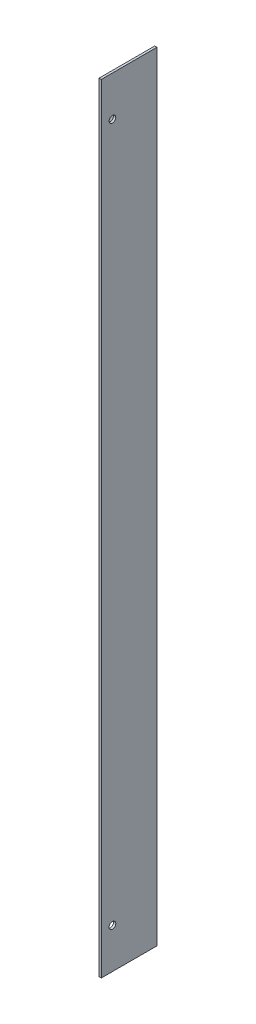
ISO-10303-21;
HEADER;
FILE_DESCRIPTION(('STEP AP214'),'2;1');
FILE_NAME('part.step','',(''),(''),'','','');
FILE_SCHEMA(('AUTOMOTIVE_DESIGN { 1 0 10303 214 1 1 1 1 }'));
ENDSEC;
DATA;
#1=APPLICATION_CONTEXT('core data for automotive mechanical design processes');
#2=APPLICATION_PROTOCOL_DEFINITION('international standard','automotive_design',2000,#1);
#3=PRODUCT_CONTEXT('',#1,'mechanical');
#4=PRODUCT('Part','Part','',(#3));
#5=PRODUCT_RELATED_PRODUCT_CATEGORY('part','',(#4));
#6=PRODUCT_DEFINITION_FORMATION('','',#4);
#7=PRODUCT_DEFINITION_CONTEXT('part definition',#1,'design');
#8=PRODUCT_DEFINITION('design','',#6,#7);
#9=PRODUCT_DEFINITION_SHAPE('','',#8);
#10=(LENGTH_UNIT() NAMED_UNIT(*) SI_UNIT(.MILLI.,.METRE.));
#11=(NAMED_UNIT(*) PLANE_ANGLE_UNIT() SI_UNIT($,.RADIAN.));
#12=(NAMED_UNIT(*) SI_UNIT($,.STERADIAN.) SOLID_ANGLE_UNIT());
#13=UNCERTAINTY_MEASURE_WITH_UNIT(LENGTH_MEASURE(1.E-05),#10,'distance_accuracy_value','');
#14=(GEOMETRIC_REPRESENTATION_CONTEXT(3) GLOBAL_UNCERTAINTY_ASSIGNED_CONTEXT((#13)) GLOBAL_UNIT_ASSIGNED_CONTEXT((#10,
#11,#12)) REPRESENTATION_CONTEXT('',''));
#15=CARTESIAN_POINT('',(0.,0.,0.));
#16=DIRECTION('',(0.,0.,1.));
#17=DIRECTION('',(1.,0.,0.));
#18=AXIS2_PLACEMENT_3D('',#15,#16,#17);
#19=CARTESIAN_POINT('',(-55.4417853066137,61.1803752262789,25.));
#20=DIRECTION('',(1.,0.,0.));
#21=DIRECTION('',(0.,1.,0.));
#22=AXIS2_PLACEMENT_3D('',#19,#20,#21);
#23=PLANE('',#22);
#24=CARTESIAN_POINT('',(-55.4417853066137,43.1803752262789,20.));
#25=DIRECTION('',(1.,0.,0.));
#26=DIRECTION('',(0.,1.,0.));
#27=AXIS2_PLACEMENT_3D('',#24,#25,#26);
#28=CIRCLE('',#27,1.5);
#29=CARTESIAN_POINT('',(-55.4417853066137,44.6803752262789,20.));
#30=VERTEX_POINT('',#29);
#31=EDGE_CURVE('E149',#30,#30,#28,.T.);
#32=ORIENTED_EDGE('',*,*,#31,.T.);
#33=EDGE_LOOP('',(#32));
#34=FACE_BOUND('',#33,.T.);
#35=CARTESIAN_POINT('',(-55.4417853066137,-270.819624773721,20.));
#36=DIRECTION('',(1.,0.,0.));
#37=DIRECTION('',(0.,1.,0.));
#38=AXIS2_PLACEMENT_3D('',#35,#36,#37);
#39=CIRCLE('',#38,1.5);
#40=CARTESIAN_POINT('',(-55.4417853066137,-269.319624773721,20.));
#41=VERTEX_POINT('',#40);
#42=EDGE_CURVE('E140',#41,#41,#39,.T.);
#43=ORIENTED_EDGE('',*,*,#42,.T.);
#44=EDGE_LOOP('',(#43));
#45=FACE_BOUND('',#44,.T.);
#46=DIRECTION('',(0.,1.,0.));
#47=VECTOR('',#46,1.);
#48=CARTESIAN_POINT('',(-55.4417853066131,61.1803752262784,1.));
#49=LINE('',#48,#47);
#50=CARTESIAN_POINT('',(-55.4417853066137,-288.819624773721,1.));
#51=VERTEX_POINT('',#50);
#52=CARTESIAN_POINT('',(-55.4417853066131,61.1803752262784,1.));
#53=VERTEX_POINT('',#52);
#54=EDGE_CURVE('E48',#51,#53,#49,.T.);
#55=ORIENTED_EDGE('',*,*,#54,.F.);
#56=DIRECTION('',(0.,0.,-1.));
#57=VECTOR('',#56,1.);
#58=CARTESIAN_POINT('',(-55.4417853066137,-288.819624773721,25.));
#59=LINE('',#58,#57);
#60=CARTESIAN_POINT('',(-55.4417853066137,-288.819624773721,25.));
#61=VERTEX_POINT('',#60);
#62=EDGE_CURVE('E11',#61,#51,#59,.T.);
#63=ORIENTED_EDGE('',*,*,#62,.F.);
#64=DIRECTION('',(0.,-1.,0.));
#65=VECTOR('',#64,1.);
#66=CARTESIAN_POINT('',(-55.4417853066137,61.1803752262789,25.));
#67=LINE('',#66,#65);
#68=CARTESIAN_POINT('',(-55.4417853066137,61.1803752262789,25.));
#69=VERTEX_POINT('',#68);
#70=EDGE_CURVE('E101',#69,#61,#67,.T.);
#71=ORIENTED_EDGE('',*,*,#70,.F.);
#72=DIRECTION('',(0.,0.,-1.));
#73=VECTOR('',#72,1.);
#74=CARTESIAN_POINT('',(-55.4417853066137,61.1803752262789,25.));
#75=LINE('',#74,#73);
#76=EDGE_CURVE('E100',#69,#53,#75,.T.);
#77=ORIENTED_EDGE('',*,*,#76,.T.);
#78=EDGE_LOOP('',(#55,#63,#71,#77));
#79=FACE_BOUND('',#78,.T.);
#80=ADVANCED_FACE('F32',(#34,#45,#79),#23,.F.);
#81=CARTESIAN_POINT('',(-55.4417853066137,-288.819624773721,25.));
#82=DIRECTION('',(0.,1.,0.));
#83=DIRECTION('',(0.,0.,1.));
#84=AXIS2_PLACEMENT_3D('',#81,#82,#83);
#85=PLANE('',#84);
#86=DIRECTION('',(1.,0.,0.));
#87=VECTOR('',#86,1.);
#88=CARTESIAN_POINT('',(-55.4417853066137,-288.819624773721,0.));
#89=LINE('',#88,#87);
#90=CARTESIAN_POINT('',(-55.4417853066137,-288.819624773721,0.));
#91=VERTEX_POINT('',#90);
#92=CARTESIAN_POINT('',(-54.4417853066137,-288.819624773721,0.));
#93=VERTEX_POINT('',#92);
#94=EDGE_CURVE('E152',#91,#93,#89,.T.);
#95=ORIENTED_EDGE('',*,*,#94,.T.);
#96=DIRECTION('',(0.,0.,-1.));
#97=VECTOR('',#96,1.);
#98=CARTESIAN_POINT('',(-54.4417853066137,-288.819624773721,25.));
#99=LINE('',#98,#97);
#100=CARTESIAN_POINT('',(-54.4417853066137,-288.819624773721,25.));
#101=VERTEX_POINT('',#100);
#102=EDGE_CURVE('E40',#101,#93,#99,.T.);
#103=ORIENTED_EDGE('',*,*,#102,.F.);
#104=DIRECTION('',(1.,0.,0.));
#105=VECTOR('',#104,1.);
#106=CARTESIAN_POINT('',(-55.4417853066137,-288.819624773721,25.));
#107=LINE('',#106,#105);
#108=EDGE_CURVE('E85',#61,#101,#107,.T.);
#109=ORIENTED_EDGE('',*,*,#108,.F.);
#110=ORIENTED_EDGE('',*,*,#62,.T.);
#111=DIRECTION('',(0.,0.,-1.));
#112=VECTOR('',#111,1.);
#113=CARTESIAN_POINT('',(-55.4417853066131,-288.819624773722,1.));
#114=LINE('',#113,#112);
#115=EDGE_CURVE('E109',#51,#91,#114,.T.);
#116=ORIENTED_EDGE('',*,*,#115,.T.);
#117=EDGE_LOOP('',(#95,#103,#109,#110,#116));
#118=FACE_BOUND('',#117,.T.);
#119=ADVANCED_FACE('F205',(#118),#85,.F.);
#120=CARTESIAN_POINT('',(-54.4417853066137,61.1803752262789,25.));
#121=DIRECTION('',(-1.,0.,0.));
#122=DIRECTION('',(0.,-1.,0.));
#123=AXIS2_PLACEMENT_3D('',#120,#121,#122);
#124=PLANE('',#123);
#125=CARTESIAN_POINT('',(-54.4417853066137,-270.819624773721,20.));
#126=DIRECTION('',(1.,0.,0.));
#127=DIRECTION('',(0.,1.,0.));
#128=AXIS2_PLACEMENT_3D('',#125,#126,#127);
#129=CIRCLE('',#128,1.5);
#130=CARTESIAN_POINT('',(-54.4417853066137,-269.319624773721,20.));
#131=VERTEX_POINT('',#130);
#132=EDGE_CURVE('E137',#131,#131,#129,.T.);
#133=ORIENTED_EDGE('',*,*,#132,.F.);
#134=EDGE_LOOP('',(#133));
#135=FACE_BOUND('',#134,.T.);
#136=CARTESIAN_POINT('',(-54.4417853066137,43.1803752262789,20.));
#137=DIRECTION('',(1.,0.,0.));
#138=DIRECTION('',(0.,1.,0.));
#139=AXIS2_PLACEMENT_3D('',#136,#137,#138);
#140=CIRCLE('',#139,1.5);
#141=CARTESIAN_POINT('',(-54.4417853066137,44.6803752262789,20.));
#142=VERTEX_POINT('',#141);
#143=EDGE_CURVE('E145',#142,#142,#140,.T.);
#144=ORIENTED_EDGE('',*,*,#143,.F.);
#145=EDGE_LOOP('',(#144));
#146=FACE_BOUND('',#145,.T.);
#147=DIRECTION('',(0.,1.,0.));
#148=VECTOR('',#147,1.);
#149=CARTESIAN_POINT('',(-54.4417853066137,61.1803752262789,0.));
#150=LINE('',#149,#148);
#151=CARTESIAN_POINT('',(-54.4417853066137,61.1803752262789,0.));
#152=VERTEX_POINT('',#151);
#153=EDGE_CURVE('E161',#93,#152,#150,.T.);
#154=ORIENTED_EDGE('',*,*,#153,.T.);
#155=DIRECTION('',(0.,0.,-1.));
#156=VECTOR('',#155,1.);
#157=CARTESIAN_POINT('',(-54.4417853066137,61.1803752262789,25.));
#158=LINE('',#157,#156);
#159=CARTESIAN_POINT('',(-54.4417853066137,61.1803752262789,25.));
#160=VERTEX_POINT('',#159);
#161=EDGE_CURVE('E102',#160,#152,#158,.T.);
#162=ORIENTED_EDGE('',*,*,#161,.F.);
#163=DIRECTION('',(0.,1.,0.));
#164=VECTOR('',#163,1.);
#165=CARTESIAN_POINT('',(-54.4417853066137,61.1803752262789,25.));
#166=LINE('',#165,#164);
#167=EDGE_CURVE('E157',#101,#160,#166,.T.);
#168=ORIENTED_EDGE('',*,*,#167,.F.);
#169=ORIENTED_EDGE('',*,*,#102,.T.);
#170=EDGE_LOOP('',(#154,#162,#168,#169));
#171=FACE_BOUND('',#170,.T.);
#172=ADVANCED_FACE('F210',(#135,#146,#171),#124,.F.);
#173=CARTESIAN_POINT('',(-55.4417853066137,61.1803752262789,25.));
#174=DIRECTION('',(0.,-1.,0.));
#175=DIRECTION('',(0.,0.,-1.));
#176=AXIS2_PLACEMENT_3D('',#173,#174,#175);
#177=PLANE('',#176);
#178=DIRECTION('',(-1.,0.,0.));
#179=VECTOR('',#178,1.);
#180=CARTESIAN_POINT('',(-55.4417853066137,61.1803752262789,0.));
#181=LINE('',#180,#179);
#182=CARTESIAN_POINT('',(-55.4417853066137,61.1803752262789,0.));
#183=VERTEX_POINT('',#182);
#184=EDGE_CURVE('E78',#152,#183,#181,.T.);
#185=ORIENTED_EDGE('',*,*,#184,.T.);
#186=DIRECTION('',(0.,0.,-1.));
#187=VECTOR('',#186,1.);
#188=CARTESIAN_POINT('',(-55.4417853066131,61.1803752262784,1.));
#189=LINE('',#188,#187);
#190=EDGE_CURVE('E104',#53,#183,#189,.T.);
#191=ORIENTED_EDGE('',*,*,#190,.F.);
#192=ORIENTED_EDGE('',*,*,#76,.F.);
#193=DIRECTION('',(-1.,0.,0.));
#194=VECTOR('',#193,1.);
#195=CARTESIAN_POINT('',(-55.4417853066137,61.1803752262789,25.));
#196=LINE('',#195,#194);
#197=EDGE_CURVE('E56',#160,#69,#196,.T.);
#198=ORIENTED_EDGE('',*,*,#197,.F.);
#199=ORIENTED_EDGE('',*,*,#161,.T.);
#200=EDGE_LOOP('',(#185,#191,#192,#198,#199));
#201=FACE_BOUND('',#200,.T.);
#202=ADVANCED_FACE('F105',(#201),#177,.F.);
#203=CARTESIAN_POINT('',(0.,0.,25.));
#204=DIRECTION('',(0.,0.,1.));
#205=DIRECTION('',(1.,0.,0.));
#206=AXIS2_PLACEMENT_3D('',#203,#204,#205);
#207=PLANE('',#206);
#208=ORIENTED_EDGE('',*,*,#70,.T.);
#209=ORIENTED_EDGE('',*,*,#108,.T.);
#210=ORIENTED_EDGE('',*,*,#167,.T.);
#211=ORIENTED_EDGE('',*,*,#197,.T.);
#212=EDGE_LOOP('',(#208,#209,#210,#211));
#213=FACE_BOUND('',#212,.T.);
#214=ADVANCED_FACE('F223',(#213),#207,.T.);
#215=CARTESIAN_POINT('',(0.,0.,0.));
#216=DIRECTION('',(0.,0.,1.));
#217=DIRECTION('',(1.,0.,0.));
#218=AXIS2_PLACEMENT_3D('',#215,#216,#217);
#219=PLANE('',#218);
#220=ORIENTED_EDGE('',*,*,#94,.F.);
#221=DIRECTION('',(0.707106781186544,-0.707106781186551,0.));
#222=VECTOR('',#221,1.);
#223=CARTESIAN_POINT('',(-55.4417853066131,-288.819624773722,0.));
#224=LINE('',#223,#222);
#225=CARTESIAN_POINT('',(-79.4417853066137,-264.819624773721,0.));
#226=VERTEX_POINT('',#225);
#227=EDGE_CURVE('E174',#226,#91,#224,.T.);
#228=ORIENTED_EDGE('',*,*,#227,.F.);
#229=DIRECTION('',(0.,-1.,0.));
#230=VECTOR('',#229,1.);
#231=CARTESIAN_POINT('',(-79.4417853066137,-264.819624773721,0.));
#232=LINE('',#231,#230);
#233=CARTESIAN_POINT('',(-79.4417853066137,37.1803752262788,0.));
#234=VERTEX_POINT('',#233);
#235=EDGE_CURVE('E135',#234,#226,#232,.T.);
#236=ORIENTED_EDGE('',*,*,#235,.F.);
#237=DIRECTION('',(-0.707106781186561,-0.707106781186535,0.));
#238=VECTOR('',#237,1.);
#239=CARTESIAN_POINT('',(-55.4417853066131,61.1803752262784,0.));
#240=LINE('',#239,#238);
#241=EDGE_CURVE('E177',#183,#234,#240,.T.);
#242=ORIENTED_EDGE('',*,*,#241,.F.);
#243=ORIENTED_EDGE('',*,*,#184,.F.);
#244=ORIENTED_EDGE('',*,*,#153,.F.);
#245=EDGE_LOOP('',(#220,#228,#236,#242,#243,#244));
#246=FACE_BOUND('',#245,.T.);
#247=CARTESIAN_POINT('',(-74.4417853066137,21.1803752262789,0.));
#248=DIRECTION('',(0.,0.,1.));
#249=DIRECTION('',(1.,0.,0.));
#250=AXIS2_PLACEMENT_3D('',#247,#248,#249);
#251=CIRCLE('',#250,1.5);
#252=CARTESIAN_POINT('',(-72.9417853066137,21.1803752262789,0.));
#253=VERTEX_POINT('',#252);
#254=EDGE_CURVE('E171',#253,#253,#251,.T.);
#255=ORIENTED_EDGE('',*,*,#254,.T.);
#256=EDGE_LOOP('',(#255));
#257=FACE_BOUND('',#256,.T.);
#258=CARTESIAN_POINT('',(-74.4417853066137,-58.8196247737215,0.));
#259=DIRECTION('',(0.,0.,1.));
#260=DIRECTION('',(1.,0.,0.));
#261=AXIS2_PLACEMENT_3D('',#258,#259,#260);
#262=CIRCLE('',#261,1.5);
#263=CARTESIAN_POINT('',(-72.9417853066137,-58.8196247737215,0.));
#264=VERTEX_POINT('',#263);
#265=EDGE_CURVE('E349',#264,#264,#262,.T.);
#266=ORIENTED_EDGE('',*,*,#265,.T.);
#267=EDGE_LOOP('',(#266));
#268=FACE_BOUND('',#267,.T.);
#269=CARTESIAN_POINT('',(-74.4417853066137,-248.819624773721,0.));
#270=DIRECTION('',(0.,0.,1.));
#271=DIRECTION('',(1.,0.,0.));
#272=AXIS2_PLACEMENT_3D('',#269,#270,#271);
#273=CIRCLE('',#272,1.5);
#274=CARTESIAN_POINT('',(-72.9417853066137,-248.819624773721,0.));
#275=VERTEX_POINT('',#274);
#276=EDGE_CURVE('E346',#275,#275,#273,.T.);
#277=ORIENTED_EDGE('',*,*,#276,.T.);
#278=EDGE_LOOP('',(#277));
#279=FACE_BOUND('',#278,.T.);
#280=ADVANCED_FACE('F188',(#246,#257,#268,#279),#219,.F.);
#281=CARTESIAN_POINT('',(-55.4417853066137,43.1803752262789,20.));
#282=DIRECTION('',(1.,0.,0.));
#283=DIRECTION('',(0.,1.,0.));
#284=AXIS2_PLACEMENT_3D('',#281,#282,#283);
#285=CYLINDRICAL_SURFACE('',#284,1.5);
#286=ORIENTED_EDGE('',*,*,#31,.F.);
#287=EDGE_LOOP('',(#286));
#288=FACE_BOUND('',#287,.T.);
#289=ORIENTED_EDGE('',*,*,#143,.T.);
#290=EDGE_LOOP('',(#289));
#291=FACE_BOUND('',#290,.T.);
#292=ADVANCED_FACE('F216',(#288,#291),#285,.F.);
#293=CARTESIAN_POINT('',(-55.4417853066137,-270.819624773721,20.));
#294=DIRECTION('',(1.,0.,0.));
#295=DIRECTION('',(0.,1.,0.));
#296=AXIS2_PLACEMENT_3D('',#293,#294,#295);
#297=CYLINDRICAL_SURFACE('',#296,1.5);
#298=ORIENTED_EDGE('',*,*,#42,.F.);
#299=EDGE_LOOP('',(#298));
#300=FACE_BOUND('',#299,.T.);
#301=ORIENTED_EDGE('',*,*,#132,.T.);
#302=EDGE_LOOP('',(#301));
#303=FACE_BOUND('',#302,.T.);
#304=ADVANCED_FACE('F200',(#300,#303),#297,.F.);
#305=CARTESIAN_POINT('',(0.,0.,1.));
#306=DIRECTION('',(0.,0.,1.));
#307=DIRECTION('',(1.,0.,0.));
#308=AXIS2_PLACEMENT_3D('',#305,#306,#307);
#309=PLANE('',#308);
#310=CARTESIAN_POINT('',(-74.4417853066137,-58.8196247737215,1.));
#311=DIRECTION('',(0.,0.,1.));
#312=DIRECTION('',(1.,0.,0.));
#313=AXIS2_PLACEMENT_3D('',#310,#311,#312);
#314=CIRCLE('',#313,1.5);
#315=CARTESIAN_POINT('',(-72.9417853066137,-58.8196247737215,1.));
#316=VERTEX_POINT('',#315);
#317=EDGE_CURVE('E352',#316,#316,#314,.T.);
#318=ORIENTED_EDGE('',*,*,#317,.F.);
#319=EDGE_LOOP('',(#318));
#320=FACE_BOUND('',#319,.T.);
#321=DIRECTION('',(0.707106781186544,-0.707106781186551,0.));
#322=VECTOR('',#321,1.);
#323=CARTESIAN_POINT('',(-55.4417853066131,-288.819624773722,1.));
#324=LINE('',#323,#322);
#325=CARTESIAN_POINT('',(-79.4417853066137,-264.819624773721,1.));
#326=VERTEX_POINT('',#325);
#327=EDGE_CURVE('E119',#326,#51,#324,.T.);
#328=ORIENTED_EDGE('',*,*,#327,.T.);
#329=ORIENTED_EDGE('',*,*,#54,.T.);
#330=DIRECTION('',(-0.707106781186561,-0.707106781186535,0.));
#331=VECTOR('',#330,1.);
#332=CARTESIAN_POINT('',(-55.4417853066131,61.1803752262784,1.));
#333=LINE('',#332,#331);
#334=CARTESIAN_POINT('',(-79.4417853066137,37.1803752262788,1.));
#335=VERTEX_POINT('',#334);
#336=EDGE_CURVE('E116',#53,#335,#333,.T.);
#337=ORIENTED_EDGE('',*,*,#336,.T.);
#338=DIRECTION('',(0.,-1.,0.));
#339=VECTOR('',#338,1.);
#340=CARTESIAN_POINT('',(-79.4417853066137,-264.819624773721,1.));
#341=LINE('',#340,#339);
#342=EDGE_CURVE('E125',#335,#326,#341,.T.);
#343=ORIENTED_EDGE('',*,*,#342,.T.);
#344=EDGE_LOOP('',(#328,#329,#337,#343));
#345=FACE_BOUND('',#344,.T.);
#346=CARTESIAN_POINT('',(-74.4417853066137,21.1803752262789,1.));
#347=DIRECTION('',(0.,0.,1.));
#348=DIRECTION('',(1.,0.,0.));
#349=AXIS2_PLACEMENT_3D('',#346,#347,#348);
#350=CIRCLE('',#349,1.5);
#351=CARTESIAN_POINT('',(-72.9417853066137,21.1803752262789,1.));
#352=VERTEX_POINT('',#351);
#353=EDGE_CURVE('E178',#352,#352,#350,.T.);
#354=ORIENTED_EDGE('',*,*,#353,.F.);
#355=EDGE_LOOP('',(#354));
#356=FACE_BOUND('',#355,.T.);
#357=CARTESIAN_POINT('',(-74.4417853066137,-248.819624773721,1.));
#358=DIRECTION('',(0.,0.,1.));
#359=DIRECTION('',(1.,0.,0.));
#360=AXIS2_PLACEMENT_3D('',#357,#358,#359);
#361=CIRCLE('',#360,1.5);
#362=CARTESIAN_POINT('',(-72.9417853066137,-248.819624773721,1.));
#363=VERTEX_POINT('',#362);
#364=EDGE_CURVE('E343',#363,#363,#361,.T.);
#365=ORIENTED_EDGE('',*,*,#364,.F.);
#366=EDGE_LOOP('',(#365));
#367=FACE_BOUND('',#366,.T.);
#368=ADVANCED_FACE('F114',(#320,#345,#356,#367),#309,.T.);
#369=CARTESIAN_POINT('',(-55.4417853066131,-288.819624773722,1.));
#370=DIRECTION('',(0.707106781186551,0.707106781186544,0.));
#371=DIRECTION('',(-0.707106781186544,0.707106781186551,0.));
#372=AXIS2_PLACEMENT_3D('',#369,#370,#371);
#373=PLANE('',#372);
#374=ORIENTED_EDGE('',*,*,#227,.T.);
#375=ORIENTED_EDGE('',*,*,#115,.F.);
#376=ORIENTED_EDGE('',*,*,#327,.F.);
#377=DIRECTION('',(0.,0.,-1.));
#378=VECTOR('',#377,1.);
#379=CARTESIAN_POINT('',(-79.4417853066137,-264.819624773721,1.));
#380=LINE('',#379,#378);
#381=EDGE_CURVE('E127',#326,#226,#380,.T.);
#382=ORIENTED_EDGE('',*,*,#381,.T.);
#383=EDGE_LOOP('',(#374,#375,#376,#382));
#384=FACE_BOUND('',#383,.T.);
#385=ADVANCED_FACE('F192',(#384),#373,.F.);
#386=CARTESIAN_POINT('',(-55.4417853066131,61.1803752262784,1.));
#387=DIRECTION('',(0.707106781186535,-0.707106781186561,0.));
#388=DIRECTION('',(0.707106781186561,0.707106781186535,0.));
#389=AXIS2_PLACEMENT_3D('',#386,#387,#388);
#390=PLANE('',#389);
#391=ORIENTED_EDGE('',*,*,#241,.T.);
#392=DIRECTION('',(0.,0.,-1.));
#393=VECTOR('',#392,1.);
#394=CARTESIAN_POINT('',(-79.4417853066137,37.1803752262788,1.));
#395=LINE('',#394,#393);
#396=EDGE_CURVE('E110',#335,#234,#395,.T.);
#397=ORIENTED_EDGE('',*,*,#396,.F.);
#398=ORIENTED_EDGE('',*,*,#336,.F.);
#399=ORIENTED_EDGE('',*,*,#190,.T.);
#400=EDGE_LOOP('',(#391,#397,#398,#399));
#401=FACE_BOUND('',#400,.T.);
#402=ADVANCED_FACE('F122',(#401),#390,.F.);
#403=CARTESIAN_POINT('',(-79.4417853066137,-264.819624773721,1.));
#404=DIRECTION('',(1.,0.,0.));
#405=DIRECTION('',(0.,0.,-1.));
#406=AXIS2_PLACEMENT_3D('',#403,#404,#405);
#407=PLANE('',#406);
#408=ORIENTED_EDGE('',*,*,#235,.T.);
#409=ORIENTED_EDGE('',*,*,#381,.F.);
#410=ORIENTED_EDGE('',*,*,#342,.F.);
#411=ORIENTED_EDGE('',*,*,#396,.T.);
#412=EDGE_LOOP('',(#408,#409,#410,#411));
#413=FACE_BOUND('',#412,.T.);
#414=ADVANCED_FACE('F184',(#413),#407,.F.);
#415=CARTESIAN_POINT('',(-74.4417853066137,21.1803752262789,1.));
#416=DIRECTION('',(0.,0.,-1.));
#417=DIRECTION('',(-1.,0.,0.));
#418=AXIS2_PLACEMENT_3D('',#415,#416,#417);
#419=CYLINDRICAL_SURFACE('',#418,1.5);
#420=ORIENTED_EDGE('',*,*,#353,.T.);
#421=EDGE_LOOP('',(#420));
#422=FACE_BOUND('',#421,.T.);
#423=ORIENTED_EDGE('',*,*,#254,.F.);
#424=EDGE_LOOP('',(#423));
#425=FACE_BOUND('',#424,.T.);
#426=ADVANCED_FACE('F307',(#422,#425),#419,.F.);
#427=CARTESIAN_POINT('',(-74.4417853066137,-58.8196247737215,1.));
#428=DIRECTION('',(0.,0.,-1.));
#429=DIRECTION('',(-1.,0.,0.));
#430=AXIS2_PLACEMENT_3D('',#427,#428,#429);
#431=CYLINDRICAL_SURFACE('',#430,1.5);
#432=ORIENTED_EDGE('',*,*,#317,.T.);
#433=EDGE_LOOP('',(#432));
#434=FACE_BOUND('',#433,.T.);
#435=ORIENTED_EDGE('',*,*,#265,.F.);
#436=EDGE_LOOP('',(#435));
#437=FACE_BOUND('',#436,.T.);
#438=ADVANCED_FACE('F315',(#434,#437),#431,.F.);
#439=CARTESIAN_POINT('',(-74.4417853066137,-248.819624773721,1.));
#440=DIRECTION('',(0.,0.,-1.));
#441=DIRECTION('',(-1.,0.,0.));
#442=AXIS2_PLACEMENT_3D('',#439,#440,#441);
#443=CYLINDRICAL_SURFACE('',#442,1.5);
#444=ORIENTED_EDGE('',*,*,#364,.T.);
#445=EDGE_LOOP('',(#444));
#446=FACE_BOUND('',#445,.T.);
#447=ORIENTED_EDGE('',*,*,#276,.F.);
#448=EDGE_LOOP('',(#447));
#449=FACE_BOUND('',#448,.T.);
#450=ADVANCED_FACE('F324',(#446,#449),#443,.F.);
#451=CLOSED_SHELL('',(#80,#119,#172,#202,#214,#280,#292,#304,#368,#385,#402,#414,#426,#438,#450));
#452=MANIFOLD_SOLID_BREP('B2',#451);
#453=ADVANCED_BREP_SHAPE_REPRESENTATION('',(#18,#452),#14);
#454=SHAPE_DEFINITION_REPRESENTATION(#9,#453);
ENDSEC;
END-ISO-10303-21;
